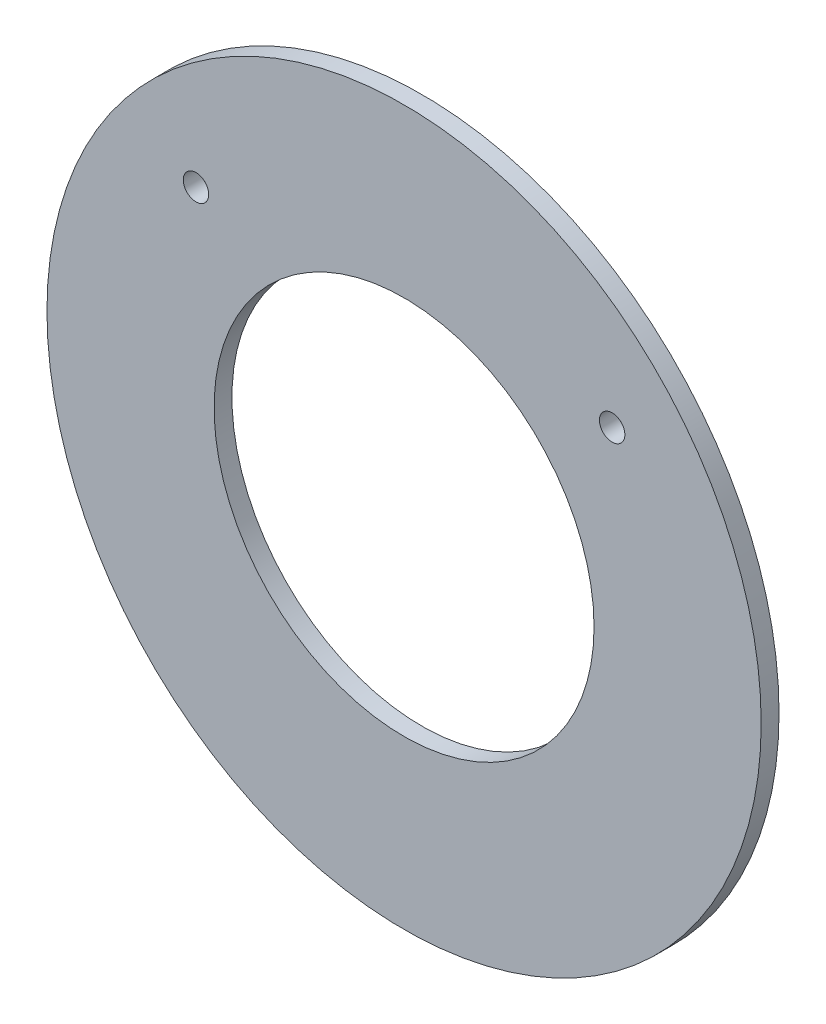
ISO-10303-21;
HEADER;
FILE_DESCRIPTION(('STEP AP214'),'2;1');
FILE_NAME('part.step','',(''),(''),'','','');
FILE_SCHEMA(('AUTOMOTIVE_DESIGN { 1 0 10303 214 1 1 1 1 }'));
ENDSEC;
DATA;
#1=APPLICATION_CONTEXT('core data for automotive mechanical design processes');
#2=APPLICATION_PROTOCOL_DEFINITION('international standard','automotive_design',2000,#1);
#3=PRODUCT_CONTEXT('',#1,'mechanical');
#4=PRODUCT('Part','Part','',(#3));
#5=PRODUCT_RELATED_PRODUCT_CATEGORY('part','',(#4));
#6=PRODUCT_DEFINITION_FORMATION('','',#4);
#7=PRODUCT_DEFINITION_CONTEXT('part definition',#1,'design');
#8=PRODUCT_DEFINITION('design','',#6,#7);
#9=PRODUCT_DEFINITION_SHAPE('','',#8);
#10=(LENGTH_UNIT() NAMED_UNIT(*) SI_UNIT(.MILLI.,.METRE.));
#11=(NAMED_UNIT(*) PLANE_ANGLE_UNIT() SI_UNIT($,.RADIAN.));
#12=(NAMED_UNIT(*) SI_UNIT($,.STERADIAN.) SOLID_ANGLE_UNIT());
#13=UNCERTAINTY_MEASURE_WITH_UNIT(LENGTH_MEASURE(1.E-05),#10,'distance_accuracy_value','');
#14=(GEOMETRIC_REPRESENTATION_CONTEXT(3) GLOBAL_UNCERTAINTY_ASSIGNED_CONTEXT((#13)) GLOBAL_UNIT_ASSIGNED_CONTEXT((#10,
#11,#12)) REPRESENTATION_CONTEXT('',''));
#15=CARTESIAN_POINT('',(0.,0.,0.));
#16=DIRECTION('',(0.,0.,1.));
#17=DIRECTION('',(1.,0.,0.));
#18=AXIS2_PLACEMENT_3D('',#15,#16,#17);
#19=CARTESIAN_POINT('',(25.5,19.155,1.5875));
#20=DIRECTION('',(0.,0.,1.));
#21=DIRECTION('',(1.,0.,0.));
#22=AXIS2_PLACEMENT_3D('',#19,#20,#21);
#23=PLANE('',#22);
#24=CARTESIAN_POINT('',(6.99999999999999,35.31,1.5875));
#25=DIRECTION('',(0.,0.,1.));
#26=DIRECTION('',(1.,0.,0.));
#27=AXIS2_PLACEMENT_3D('',#24,#25,#26);
#28=CIRCLE('',#27,1.1303);
#29=CARTESIAN_POINT('',(8.13029999999999,35.31,1.5875));
#30=VERTEX_POINT('',#29);
#31=EDGE_CURVE('E47',#30,#30,#28,.F.);
#32=ORIENTED_EDGE('',*,*,#31,.T.);
#33=EDGE_LOOP('',(#32));
#34=FACE_BOUND('',#33,.T.);
#35=CARTESIAN_POINT('',(44.,35.31,1.5875));
#36=DIRECTION('',(0.,0.,1.));
#37=DIRECTION('',(1.,0.,0.));
#38=AXIS2_PLACEMENT_3D('',#35,#36,#37);
#39=CIRCLE('',#38,1.1303);
#40=CARTESIAN_POINT('',(45.1303,35.31,1.5875));
#41=VERTEX_POINT('',#40);
#42=EDGE_CURVE('E50',#41,#41,#39,.F.);
#43=ORIENTED_EDGE('',*,*,#42,.T.);
#44=EDGE_LOOP('',(#43));
#45=FACE_BOUND('',#44,.T.);
#46=CARTESIAN_POINT('',(25.5,19.155,1.5875));
#47=DIRECTION('',(0.,0.,1.));
#48=DIRECTION('',(1.,0.,0.));
#49=AXIS2_PLACEMENT_3D('',#46,#47,#48);
#50=CIRCLE('',#49,31.75);
#51=CARTESIAN_POINT('',(57.25,19.155,1.5875));
#52=VERTEX_POINT('',#51);
#53=EDGE_CURVE('E10',#52,#52,#50,.T.);
#54=ORIENTED_EDGE('',*,*,#53,.T.);
#55=EDGE_LOOP('',(#54));
#56=FACE_BOUND('',#55,.T.);
#57=CARTESIAN_POINT('',(25.5,19.155,1.5875));
#58=DIRECTION('',(0.,0.,1.));
#59=DIRECTION('',(1.,0.,0.));
#60=AXIS2_PLACEMENT_3D('',#57,#58,#59);
#61=CIRCLE('',#60,16.891);
#62=CARTESIAN_POINT('',(42.391,19.155,1.5875));
#63=VERTEX_POINT('',#62);
#64=EDGE_CURVE('E42',#63,#63,#61,.T.);
#65=ORIENTED_EDGE('',*,*,#64,.F.);
#66=EDGE_LOOP('',(#65));
#67=FACE_BOUND('',#66,.T.);
#68=ADVANCED_FACE('F31',(#34,#45,#56,#67),#23,.T.);
#69=CARTESIAN_POINT('',(25.5,19.155,0.));
#70=DIRECTION('',(0.,0.,1.));
#71=DIRECTION('',(1.,0.,0.));
#72=AXIS2_PLACEMENT_3D('',#69,#70,#71);
#73=PLANE('',#72);
#74=CARTESIAN_POINT('',(6.99999999999999,35.31,0.));
#75=DIRECTION('',(0.,0.,-1.));
#76=DIRECTION('',(-1.,0.,0.));
#77=AXIS2_PLACEMENT_3D('',#74,#75,#76);
#78=CIRCLE('',#77,1.1303);
#79=CARTESIAN_POINT('',(5.86969999999999,35.31,0.));
#80=VERTEX_POINT('',#79);
#81=EDGE_CURVE('E53',#80,#80,#78,.T.);
#82=ORIENTED_EDGE('',*,*,#81,.F.);
#83=EDGE_LOOP('',(#82));
#84=FACE_BOUND('',#83,.T.);
#85=CARTESIAN_POINT('',(44.,35.31,0.));
#86=DIRECTION('',(0.,0.,-1.));
#87=DIRECTION('',(-1.,0.,0.));
#88=AXIS2_PLACEMENT_3D('',#85,#86,#87);
#89=CIRCLE('',#88,1.1303);
#90=CARTESIAN_POINT('',(42.8697,35.31,0.));
#91=VERTEX_POINT('',#90);
#92=EDGE_CURVE('E54',#91,#91,#89,.T.);
#93=ORIENTED_EDGE('',*,*,#92,.F.);
#94=EDGE_LOOP('',(#93));
#95=FACE_BOUND('',#94,.T.);
#96=CARTESIAN_POINT('',(25.5,19.155,0.));
#97=DIRECTION('',(0.,0.,1.));
#98=DIRECTION('',(1.,0.,0.));
#99=AXIS2_PLACEMENT_3D('',#96,#97,#98);
#100=CIRCLE('',#99,31.75);
#101=CARTESIAN_POINT('',(57.25,19.155,0.));
#102=VERTEX_POINT('',#101);
#103=EDGE_CURVE('E35',#102,#102,#100,.T.);
#104=ORIENTED_EDGE('',*,*,#103,.F.);
#105=EDGE_LOOP('',(#104));
#106=FACE_BOUND('',#105,.T.);
#107=CARTESIAN_POINT('',(25.5,19.155,0.));
#108=DIRECTION('',(0.,0.,1.));
#109=DIRECTION('',(1.,0.,0.));
#110=AXIS2_PLACEMENT_3D('',#107,#108,#109);
#111=CIRCLE('',#110,16.891);
#112=CARTESIAN_POINT('',(42.391,19.155,0.));
#113=VERTEX_POINT('',#112);
#114=EDGE_CURVE('E44',#113,#113,#111,.T.);
#115=ORIENTED_EDGE('',*,*,#114,.T.);
#116=EDGE_LOOP('',(#115));
#117=FACE_BOUND('',#116,.T.);
#118=ADVANCED_FACE('F65',(#84,#95,#106,#117),#73,.F.);
#119=CARTESIAN_POINT('',(25.5,19.155,1.5875));
#120=DIRECTION('',(0.,0.,-1.));
#121=DIRECTION('',(-1.,0.,0.));
#122=AXIS2_PLACEMENT_3D('',#119,#120,#121);
#123=CYLINDRICAL_SURFACE('',#122,31.75);
#124=ORIENTED_EDGE('',*,*,#53,.F.);
#125=EDGE_LOOP('',(#124));
#126=FACE_BOUND('',#125,.T.);
#127=ORIENTED_EDGE('',*,*,#103,.T.);
#128=EDGE_LOOP('',(#127));
#129=FACE_BOUND('',#128,.T.);
#130=ADVANCED_FACE('F33',(#126,#129),#123,.T.);
#131=CARTESIAN_POINT('',(25.5,19.155,1.5875));
#132=DIRECTION('',(0.,0.,-1.));
#133=DIRECTION('',(-1.,0.,0.));
#134=AXIS2_PLACEMENT_3D('',#131,#132,#133);
#135=CYLINDRICAL_SURFACE('',#134,16.891);
#136=ORIENTED_EDGE('',*,*,#64,.T.);
#137=EDGE_LOOP('',(#136));
#138=FACE_BOUND('',#137,.T.);
#139=ORIENTED_EDGE('',*,*,#114,.F.);
#140=EDGE_LOOP('',(#139));
#141=FACE_BOUND('',#140,.T.);
#142=ADVANCED_FACE('F74',(#138,#141),#135,.F.);
#143=CARTESIAN_POINT('',(44.,35.31,4.78447117910062));
#144=DIRECTION('',(0.,0.,-1.));
#145=DIRECTION('',(-1.,0.,0.));
#146=AXIS2_PLACEMENT_3D('',#143,#144,#145);
#147=CYLINDRICAL_SURFACE('',#146,1.1303);
#148=ORIENTED_EDGE('',*,*,#92,.T.);
#149=EDGE_LOOP('',(#148));
#150=FACE_BOUND('',#149,.T.);
#151=ORIENTED_EDGE('',*,*,#42,.F.);
#152=EDGE_LOOP('',(#151));
#153=FACE_BOUND('',#152,.T.);
#154=ADVANCED_FACE('F76',(#150,#153),#147,.F.);
#155=CARTESIAN_POINT('',(6.99999999999999,35.31,4.78447117910062));
#156=DIRECTION('',(0.,0.,-1.));
#157=DIRECTION('',(-1.,0.,0.));
#158=AXIS2_PLACEMENT_3D('',#155,#156,#157);
#159=CYLINDRICAL_SURFACE('',#158,1.1303);
#160=ORIENTED_EDGE('',*,*,#81,.T.);
#161=EDGE_LOOP('',(#160));
#162=FACE_BOUND('',#161,.T.);
#163=ORIENTED_EDGE('',*,*,#31,.F.);
#164=EDGE_LOOP('',(#163));
#165=FACE_BOUND('',#164,.T.);
#166=ADVANCED_FACE('F62',(#162,#165),#159,.F.);
#167=CLOSED_SHELL('',(#68,#118,#130,#142,#154,#166));
#168=MANIFOLD_SOLID_BREP('B2',#167);
#169=ADVANCED_BREP_SHAPE_REPRESENTATION('',(#18,#168),#14);
#170=SHAPE_DEFINITION_REPRESENTATION(#9,#169);
ENDSEC;
END-ISO-10303-21;
